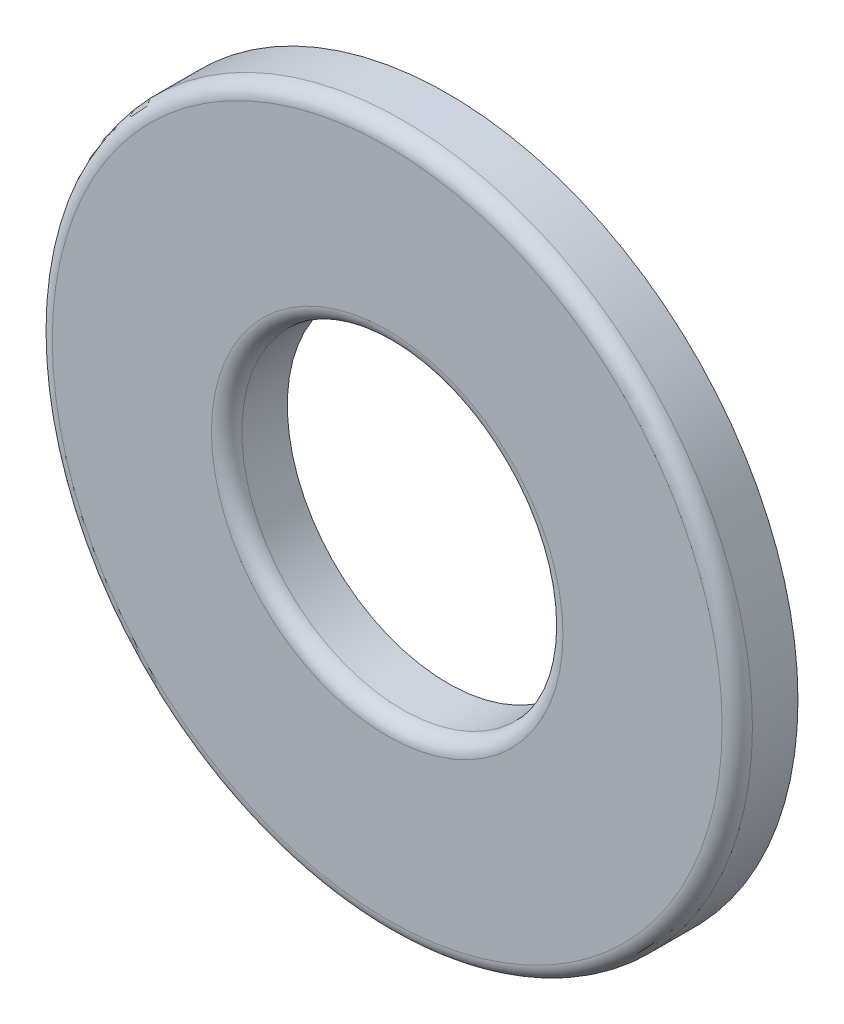
ISO-10303-21;
HEADER;
FILE_DESCRIPTION(('STEP AP214'),'2;1');
FILE_NAME('part.step','',(''),(''),'','','');
FILE_SCHEMA(('AUTOMOTIVE_DESIGN { 1 0 10303 214 1 1 1 1 }'));
ENDSEC;
DATA;
#1=APPLICATION_CONTEXT('core data for automotive mechanical design processes');
#2=APPLICATION_PROTOCOL_DEFINITION('international standard','automotive_design',2000,#1);
#3=PRODUCT_CONTEXT('',#1,'mechanical');
#4=PRODUCT('Part','Part','',(#3));
#5=PRODUCT_RELATED_PRODUCT_CATEGORY('part','',(#4));
#6=PRODUCT_DEFINITION_FORMATION('','',#4);
#7=PRODUCT_DEFINITION_CONTEXT('part definition',#1,'design');
#8=PRODUCT_DEFINITION('design','',#6,#7);
#9=PRODUCT_DEFINITION_SHAPE('','',#8);
#10=(LENGTH_UNIT() NAMED_UNIT(*) SI_UNIT(.MILLI.,.METRE.));
#11=(NAMED_UNIT(*) PLANE_ANGLE_UNIT() SI_UNIT($,.RADIAN.));
#12=(NAMED_UNIT(*) SI_UNIT($,.STERADIAN.) SOLID_ANGLE_UNIT());
#13=UNCERTAINTY_MEASURE_WITH_UNIT(LENGTH_MEASURE(1.E-05),#10,'distance_accuracy_value','');
#14=(GEOMETRIC_REPRESENTATION_CONTEXT(3) GLOBAL_UNCERTAINTY_ASSIGNED_CONTEXT((#13)) GLOBAL_UNIT_ASSIGNED_CONTEXT((#10,
#11,#12)) REPRESENTATION_CONTEXT('',''));
#15=CARTESIAN_POINT('',(0.,0.,0.));
#16=DIRECTION('',(0.,0.,1.));
#17=DIRECTION('',(1.,0.,0.));
#18=AXIS2_PLACEMENT_3D('',#15,#16,#17);
#19=CARTESIAN_POINT('',(0.,0.,0.412749999999997));
#20=DIRECTION('',(0.,0.,1.));
#21=DIRECTION('',(1.,0.,0.));
#22=AXIS2_PLACEMENT_3D('',#19,#20,#21);
#23=PLANE('',#22);
#24=CARTESIAN_POINT('',(0.,0.,0.412749999999997));
#25=DIRECTION('',(0.,0.,1.));
#26=DIRECTION('',(1.,0.,0.));
#27=AXIS2_PLACEMENT_3D('',#24,#25,#26);
#28=CIRCLE('',#27,4.556125);
#29=CARTESIAN_POINT('',(4.556125,0.,0.412749999999997));
#30=VERTEX_POINT('',#29);
#31=EDGE_CURVE('E57',#30,#30,#28,.T.);
#32=ORIENTED_EDGE('',*,*,#31,.T.);
#33=EDGE_LOOP('',(#32));
#34=FACE_BOUND('',#33,.T.);
#35=CARTESIAN_POINT('',(0.,0.,0.412749999999997));
#36=DIRECTION('',(0.,0.,1.));
#37=DIRECTION('',(1.,0.,0.));
#38=AXIS2_PLACEMENT_3D('',#35,#36,#37);
#39=CIRCLE('',#38,2.390775);
#40=CARTESIAN_POINT('',(2.390775,0.,0.412749999999997));
#41=VERTEX_POINT('',#40);
#42=EDGE_CURVE('E63',#41,#41,#39,.F.);
#43=ORIENTED_EDGE('',*,*,#42,.T.);
#44=EDGE_LOOP('',(#43));
#45=FACE_BOUND('',#44,.T.);
#46=ADVANCED_FACE('F43',(#34,#45),#23,.T.);
#47=CARTESIAN_POINT('',(0.,0.,0.412749999999997));
#48=DIRECTION('',(0.,0.,-1.));
#49=DIRECTION('',(-1.,0.,0.));
#50=AXIS2_PLACEMENT_3D('',#47,#48,#49);
#51=CYLINDRICAL_SURFACE('',#50,4.7625);
#52=CARTESIAN_POINT('',(0.,0.,0.206374999999997));
#53=DIRECTION('',(0.,0.,1.));
#54=DIRECTION('',(1.,0.,0.));
#55=AXIS2_PLACEMENT_3D('',#52,#53,#54);
#56=CIRCLE('',#55,4.7625);
#57=CARTESIAN_POINT('',(4.7625,0.,0.206374999999997));
#58=VERTEX_POINT('',#57);
#59=EDGE_CURVE('E51',#58,#58,#56,.F.);
#60=ORIENTED_EDGE('',*,*,#59,.T.);
#61=EDGE_LOOP('',(#60));
#62=FACE_BOUND('',#61,.T.);
#63=CARTESIAN_POINT('',(0.,0.,-0.412750000000003));
#64=DIRECTION('',(0.,0.,1.));
#65=DIRECTION('',(1.,0.,0.));
#66=AXIS2_PLACEMENT_3D('',#63,#64,#65);
#67=CIRCLE('',#66,4.7625);
#68=CARTESIAN_POINT('',(4.7625,0.,-0.412750000000003));
#69=VERTEX_POINT('',#68);
#70=EDGE_CURVE('E69',#69,#69,#67,.T.);
#71=ORIENTED_EDGE('',*,*,#70,.T.);
#72=EDGE_LOOP('',(#71));
#73=FACE_BOUND('',#72,.T.);
#74=ADVANCED_FACE('F84',(#62,#73),#51,.T.);
#75=CARTESIAN_POINT('',(0.,0.,0.412749999999997));
#76=DIRECTION('',(0.,0.,-1.));
#77=DIRECTION('',(-1.,0.,0.));
#78=AXIS2_PLACEMENT_3D('',#75,#76,#77);
#79=CYLINDRICAL_SURFACE('',#78,2.1844);
#80=CARTESIAN_POINT('',(0.,0.,0.206374999999997));
#81=DIRECTION('',(0.,0.,1.));
#82=DIRECTION('',(1.,0.,0.));
#83=AXIS2_PLACEMENT_3D('',#80,#81,#82);
#84=CIRCLE('',#83,2.1844);
#85=CARTESIAN_POINT('',(2.1844,0.,0.206374999999997));
#86=VERTEX_POINT('',#85);
#87=EDGE_CURVE('E10',#86,#86,#84,.T.);
#88=ORIENTED_EDGE('',*,*,#87,.T.);
#89=EDGE_LOOP('',(#88));
#90=FACE_BOUND('',#89,.T.);
#91=CARTESIAN_POINT('',(0.,0.,-0.412750000000003));
#92=DIRECTION('',(0.,0.,1.));
#93=DIRECTION('',(1.,0.,0.));
#94=AXIS2_PLACEMENT_3D('',#91,#92,#93);
#95=CIRCLE('',#94,2.1844);
#96=CARTESIAN_POINT('',(2.1844,0.,-0.412750000000003));
#97=VERTEX_POINT('',#96);
#98=EDGE_CURVE('E73',#97,#97,#95,.T.);
#99=ORIENTED_EDGE('',*,*,#98,.F.);
#100=EDGE_LOOP('',(#99));
#101=FACE_BOUND('',#100,.T.);
#102=ADVANCED_FACE('F82',(#90,#101),#79,.F.);
#103=CARTESIAN_POINT('',(0.,0.,-0.412750000000003));
#104=DIRECTION('',(0.,0.,1.));
#105=DIRECTION('',(1.,0.,0.));
#106=AXIS2_PLACEMENT_3D('',#103,#104,#105);
#107=PLANE('',#106);
#108=ORIENTED_EDGE('',*,*,#98,.T.);
#109=EDGE_LOOP('',(#108));
#110=FACE_BOUND('',#109,.T.);
#111=ORIENTED_EDGE('',*,*,#70,.F.);
#112=EDGE_LOOP('',(#111));
#113=FACE_BOUND('',#112,.T.);
#114=ADVANCED_FACE('F79',(#110,#113),#107,.F.);
#115=CARTESIAN_POINT('',(0.,0.,0.206374999999997));
#116=DIRECTION('',(0.,0.,1.));
#117=DIRECTION('',(1.,0.,0.));
#118=AXIS2_PLACEMENT_3D('',#115,#116,#117);
#119=TOROIDAL_SURFACE('',#118,4.556125,0.206375);
#120=ORIENTED_EDGE('',*,*,#59,.F.);
#121=EDGE_LOOP('',(#120));
#122=FACE_BOUND('',#121,.T.);
#123=ORIENTED_EDGE('',*,*,#31,.F.);
#124=EDGE_LOOP('',(#123));
#125=FACE_BOUND('',#124,.T.);
#126=ADVANCED_FACE('F90',(#122,#125),#119,.T.);
#127=CARTESIAN_POINT('',(0.,0.,0.206374999999997));
#128=DIRECTION('',(0.,0.,1.));
#129=DIRECTION('',(1.,0.,0.));
#130=AXIS2_PLACEMENT_3D('',#127,#128,#129);
#131=TOROIDAL_SURFACE('',#130,2.390775,0.206375);
#132=ORIENTED_EDGE('',*,*,#42,.F.);
#133=EDGE_LOOP('',(#132));
#134=FACE_BOUND('',#133,.T.);
#135=ORIENTED_EDGE('',*,*,#87,.F.);
#136=EDGE_LOOP('',(#135));
#137=FACE_BOUND('',#136,.T.);
#138=ADVANCED_FACE('F45',(#134,#137),#131,.T.);
#139=CLOSED_SHELL('',(#46,#74,#102,#114,#126,#138));
#140=MANIFOLD_SOLID_BREP('B2',#139);
#141=ADVANCED_BREP_SHAPE_REPRESENTATION('',(#18,#140),#14);
#142=SHAPE_DEFINITION_REPRESENTATION(#9,#141);
ENDSEC;
END-ISO-10303-21;
